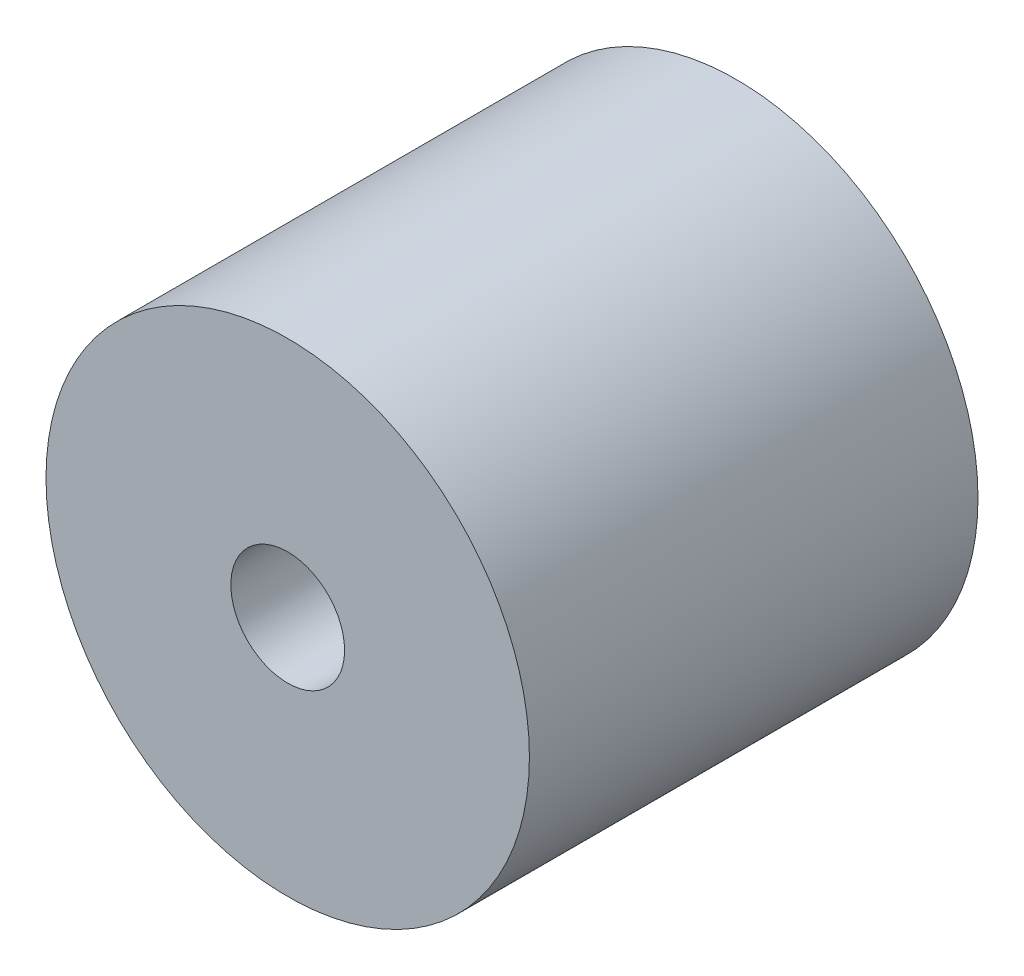
ISO-10303-21;
HEADER;
FILE_DESCRIPTION(('STEP AP214'),'2;1');
FILE_NAME('part.step','',(''),(''),'','','');
FILE_SCHEMA(('AUTOMOTIVE_DESIGN { 1 0 10303 214 1 1 1 1 }'));
ENDSEC;
DATA;
#1=APPLICATION_CONTEXT('core data for automotive mechanical design processes');
#2=APPLICATION_PROTOCOL_DEFINITION('international standard','automotive_design',2000,#1);
#3=PRODUCT_CONTEXT('',#1,'mechanical');
#4=PRODUCT('Part','Part','',(#3));
#5=PRODUCT_RELATED_PRODUCT_CATEGORY('part','',(#4));
#6=PRODUCT_DEFINITION_FORMATION('','',#4);
#7=PRODUCT_DEFINITION_CONTEXT('part definition',#1,'design');
#8=PRODUCT_DEFINITION('design','',#6,#7);
#9=PRODUCT_DEFINITION_SHAPE('','',#8);
#10=(LENGTH_UNIT() NAMED_UNIT(*) SI_UNIT(.MILLI.,.METRE.));
#11=(NAMED_UNIT(*) PLANE_ANGLE_UNIT() SI_UNIT($,.RADIAN.));
#12=(NAMED_UNIT(*) SI_UNIT($,.STERADIAN.) SOLID_ANGLE_UNIT());
#13=UNCERTAINTY_MEASURE_WITH_UNIT(LENGTH_MEASURE(1.E-05),#10,'distance_accuracy_value','');
#14=(GEOMETRIC_REPRESENTATION_CONTEXT(3) GLOBAL_UNCERTAINTY_ASSIGNED_CONTEXT((#13)) GLOBAL_UNIT_ASSIGNED_CONTEXT((#10,
#11,#12)) REPRESENTATION_CONTEXT('',''));
#15=CARTESIAN_POINT('',(0.,0.,0.));
#16=DIRECTION('',(0.,0.,1.));
#17=DIRECTION('',(1.,0.,0.));
#18=AXIS2_PLACEMENT_3D('',#15,#16,#17);
#19=CARTESIAN_POINT('',(0.,0.,31.55));
#20=DIRECTION('',(0.,0.,1.));
#21=DIRECTION('',(1.,0.,0.));
#22=AXIS2_PLACEMENT_3D('',#19,#20,#21);
#23=PLANE('',#22);
#24=CARTESIAN_POINT('',(0.,0.,31.55));
#25=DIRECTION('',(0.,0.,1.));
#26=DIRECTION('',(1.,0.,0.));
#27=AXIS2_PLACEMENT_3D('',#24,#25,#26);
#28=CIRCLE('',#27,34.);
#29=CARTESIAN_POINT('',(34.,0.,31.55));
#30=VERTEX_POINT('',#29);
#31=EDGE_CURVE('E59',#30,#30,#28,.T.);
#32=ORIENTED_EDGE('',*,*,#31,.T.);
#33=EDGE_LOOP('',(#32));
#34=FACE_BOUND('',#33,.T.);
#35=CARTESIAN_POINT('',(0.,0.,31.55));
#36=DIRECTION('',(0.,0.,1.));
#37=DIRECTION('',(1.,0.,0.));
#38=AXIS2_PLACEMENT_3D('',#35,#36,#37);
#39=CIRCLE('',#38,8.);
#40=CARTESIAN_POINT('',(8.,0.,31.55));
#41=VERTEX_POINT('',#40);
#42=EDGE_CURVE('E66',#41,#41,#39,.T.);
#43=ORIENTED_EDGE('',*,*,#42,.F.);
#44=EDGE_LOOP('',(#43));
#45=FACE_BOUND('',#44,.T.);
#46=ADVANCED_FACE('F36',(#34,#45),#23,.T.);
#47=CARTESIAN_POINT('',(0.,0.,-31.55));
#48=DIRECTION('',(0.,0.,1.));
#49=DIRECTION('',(1.,0.,0.));
#50=AXIS2_PLACEMENT_3D('',#47,#48,#49);
#51=PLANE('',#50);
#52=CARTESIAN_POINT('',(0.,0.,-31.55));
#53=DIRECTION('',(0.,0.,1.));
#54=DIRECTION('',(1.,0.,0.));
#55=AXIS2_PLACEMENT_3D('',#52,#53,#54);
#56=CIRCLE('',#55,34.);
#57=CARTESIAN_POINT('',(34.,0.,-31.55));
#58=VERTEX_POINT('',#57);
#59=EDGE_CURVE('E53',#58,#58,#56,.T.);
#60=ORIENTED_EDGE('',*,*,#59,.F.);
#61=EDGE_LOOP('',(#60));
#62=FACE_BOUND('',#61,.T.);
#63=CARTESIAN_POINT('',(0.,0.,-31.55));
#64=DIRECTION('',(0.,0.,1.));
#65=DIRECTION('',(1.,0.,0.));
#66=AXIS2_PLACEMENT_3D('',#63,#64,#65);
#67=CIRCLE('',#66,8.);
#68=CARTESIAN_POINT('',(8.,0.,-31.55));
#69=VERTEX_POINT('',#68);
#70=EDGE_CURVE('E68',#69,#69,#67,.T.);
#71=ORIENTED_EDGE('',*,*,#70,.T.);
#72=EDGE_LOOP('',(#71));
#73=FACE_BOUND('',#72,.T.);
#74=ADVANCED_FACE('F78',(#62,#73),#51,.F.);
#75=CARTESIAN_POINT('',(0.,0.,31.55));
#76=DIRECTION('',(0.,0.,-1.));
#77=DIRECTION('',(-1.,0.,0.));
#78=AXIS2_PLACEMENT_3D('',#75,#76,#77);
#79=CYLINDRICAL_SURFACE('',#78,34.);
#80=ORIENTED_EDGE('',*,*,#31,.F.);
#81=EDGE_LOOP('',(#80));
#82=FACE_BOUND('',#81,.T.);
#83=ORIENTED_EDGE('',*,*,#59,.T.);
#84=EDGE_LOOP('',(#83));
#85=FACE_BOUND('',#84,.T.);
#86=ADVANCED_FACE('F83',(#82,#85),#79,.T.);
#87=CARTESIAN_POINT('',(0.,0.,31.55));
#88=DIRECTION('',(0.,0.,-1.));
#89=DIRECTION('',(-1.,0.,0.));
#90=AXIS2_PLACEMENT_3D('',#87,#88,#89);
#91=CYLINDRICAL_SURFACE('',#90,8.);
#92=ORIENTED_EDGE('',*,*,#42,.T.);
#93=EDGE_LOOP('',(#92));
#94=FACE_BOUND('',#93,.T.);
#95=ORIENTED_EDGE('',*,*,#70,.F.);
#96=EDGE_LOOP('',(#95));
#97=FACE_BOUND('',#96,.T.);
#98=ADVANCED_FACE('F74',(#94,#97),#91,.F.);
#99=CLOSED_SHELL('',(#46,#74,#86,#98));
#100=CARTESIAN_POINT('',(0.,0.,28.05));
#101=DIRECTION('',(0.,0.,1.));
#102=DIRECTION('',(1.,0.,0.));
#103=AXIS2_PLACEMENT_3D('',#100,#101,#102);
#104=PLANE('',#103);
#105=CARTESIAN_POINT('',(0.,0.,28.05));
#106=DIRECTION('',(0.,0.,1.));
#107=DIRECTION('',(1.,0.,0.));
#108=AXIS2_PLACEMENT_3D('',#105,#106,#107);
#109=CIRCLE('',#108,30.5);
#110=CARTESIAN_POINT('',(30.5,0.,28.05));
#111=VERTEX_POINT('',#110);
#112=EDGE_CURVE('E40',#111,#111,#109,.T.);
#113=ORIENTED_EDGE('',*,*,#112,.F.);
#114=EDGE_LOOP('',(#113));
#115=FACE_BOUND('',#114,.T.);
#116=CARTESIAN_POINT('',(0.,0.,28.05));
#117=DIRECTION('',(0.,0.,1.));
#118=DIRECTION('',(1.,0.,0.));
#119=AXIS2_PLACEMENT_3D('',#116,#117,#118);
#120=CIRCLE('',#119,11.5);
#121=CARTESIAN_POINT('',(11.5,0.,28.05));
#122=VERTEX_POINT('',#121);
#123=EDGE_CURVE('E10',#122,#122,#120,.T.);
#124=ORIENTED_EDGE('',*,*,#123,.T.);
#125=EDGE_LOOP('',(#124));
#126=FACE_BOUND('',#125,.T.);
#127=ADVANCED_FACE('F91',(#115,#126),#104,.F.);
#128=CARTESIAN_POINT('',(0.,0.,-28.05));
#129=DIRECTION('',(0.,0.,1.));
#130=DIRECTION('',(1.,0.,0.));
#131=AXIS2_PLACEMENT_3D('',#128,#129,#130);
#132=PLANE('',#131);
#133=CARTESIAN_POINT('',(0.,0.,-28.05));
#134=DIRECTION('',(0.,0.,1.));
#135=DIRECTION('',(1.,0.,0.));
#136=AXIS2_PLACEMENT_3D('',#133,#134,#135);
#137=CIRCLE('',#136,30.5);
#138=CARTESIAN_POINT('',(30.5,0.,-28.05));
#139=VERTEX_POINT('',#138);
#140=EDGE_CURVE('E45',#139,#139,#137,.T.);
#141=ORIENTED_EDGE('',*,*,#140,.T.);
#142=EDGE_LOOP('',(#141));
#143=FACE_BOUND('',#142,.T.);
#144=CARTESIAN_POINT('',(0.,0.,-28.05));
#145=DIRECTION('',(0.,0.,1.));
#146=DIRECTION('',(1.,0.,0.));
#147=AXIS2_PLACEMENT_3D('',#144,#145,#146);
#148=CIRCLE('',#147,11.5);
#149=CARTESIAN_POINT('',(11.5,0.,-28.05));
#150=VERTEX_POINT('',#149);
#151=EDGE_CURVE('E50',#150,#150,#148,.T.);
#152=ORIENTED_EDGE('',*,*,#151,.F.);
#153=EDGE_LOOP('',(#152));
#154=FACE_BOUND('',#153,.T.);
#155=ADVANCED_FACE('F94',(#143,#154),#132,.T.);
#156=CARTESIAN_POINT('',(0.,0.,31.55));
#157=DIRECTION('',(0.,0.,-1.));
#158=DIRECTION('',(-1.,0.,0.));
#159=AXIS2_PLACEMENT_3D('',#156,#157,#158);
#160=CYLINDRICAL_SURFACE('',#159,30.5);
#161=ORIENTED_EDGE('',*,*,#112,.T.);
#162=EDGE_LOOP('',(#161));
#163=FACE_BOUND('',#162,.T.);
#164=ORIENTED_EDGE('',*,*,#140,.F.);
#165=EDGE_LOOP('',(#164));
#166=FACE_BOUND('',#165,.T.);
#167=ADVANCED_FACE('F98',(#163,#166),#160,.F.);
#168=CARTESIAN_POINT('',(0.,0.,31.55));
#169=DIRECTION('',(0.,0.,-1.));
#170=DIRECTION('',(-1.,0.,0.));
#171=AXIS2_PLACEMENT_3D('',#168,#169,#170);
#172=CYLINDRICAL_SURFACE('',#171,11.5);
#173=ORIENTED_EDGE('',*,*,#123,.F.);
#174=EDGE_LOOP('',(#173));
#175=FACE_BOUND('',#174,.T.);
#176=ORIENTED_EDGE('',*,*,#151,.T.);
#177=EDGE_LOOP('',(#176));
#178=FACE_BOUND('',#177,.T.);
#179=ADVANCED_FACE('F38',(#175,#178),#172,.T.);
#180=CLOSED_SHELL('',(#127,#155,#167,#179));
#181=ORIENTED_CLOSED_SHELL('',*,#180,.T.);
#182=BREP_WITH_VOIDS('B2',#99,(#181));
#183=ADVANCED_BREP_SHAPE_REPRESENTATION('',(#18,#182),#14);
#184=SHAPE_DEFINITION_REPRESENTATION(#9,#183);
ENDSEC;
END-ISO-10303-21;
